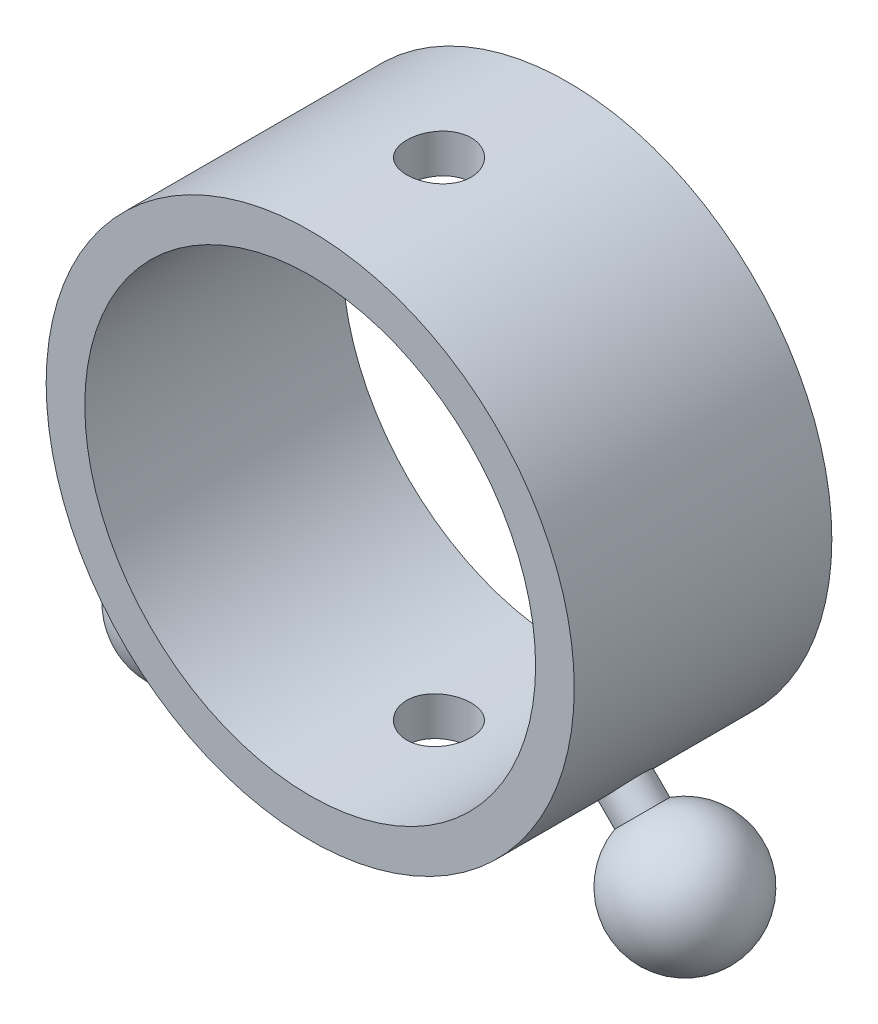
ISO-10303-21;
HEADER;
FILE_DESCRIPTION(('STEP AP214'),'2;1');
FILE_NAME('part.step','',(''),(''),'','','');
FILE_SCHEMA(('AUTOMOTIVE_DESIGN { 1 0 10303 214 1 1 1 1 }'));
ENDSEC;
DATA;
#1=APPLICATION_CONTEXT('core data for automotive mechanical design processes');
#2=APPLICATION_PROTOCOL_DEFINITION('international standard','automotive_design',2000,#1);
#3=PRODUCT_CONTEXT('',#1,'mechanical');
#4=PRODUCT('Part','Part','',(#3));
#5=PRODUCT_RELATED_PRODUCT_CATEGORY('part','',(#4));
#6=PRODUCT_DEFINITION_FORMATION('','',#4);
#7=PRODUCT_DEFINITION_CONTEXT('part definition',#1,'design');
#8=PRODUCT_DEFINITION('design','',#6,#7);
#9=PRODUCT_DEFINITION_SHAPE('','',#8);
#10=(LENGTH_UNIT() NAMED_UNIT(*) SI_UNIT(.MILLI.,.METRE.));
#11=(NAMED_UNIT(*) PLANE_ANGLE_UNIT() SI_UNIT($,.RADIAN.));
#12=(NAMED_UNIT(*) SI_UNIT($,.STERADIAN.) SOLID_ANGLE_UNIT());
#13=UNCERTAINTY_MEASURE_WITH_UNIT(LENGTH_MEASURE(1.E-05),#10,'distance_accuracy_value','');
#14=(GEOMETRIC_REPRESENTATION_CONTEXT(3) GLOBAL_UNCERTAINTY_ASSIGNED_CONTEXT((#13)) GLOBAL_UNIT_ASSIGNED_CONTEXT((#10,
#11,#12)) REPRESENTATION_CONTEXT('',''));
#15=CARTESIAN_POINT('',(0.,0.,0.));
#16=DIRECTION('',(0.,0.,1.));
#17=DIRECTION('',(1.,0.,0.));
#18=AXIS2_PLACEMENT_3D('',#15,#16,#17);
#19=CARTESIAN_POINT('',(0.,0.,20.));
#20=DIRECTION('',(0.,0.,1.));
#21=DIRECTION('',(1.,0.,0.));
#22=AXIS2_PLACEMENT_3D('',#19,#20,#21);
#23=PLANE('',#22);
#24=CARTESIAN_POINT('',(0.,0.,20.));
#25=DIRECTION('',(0.,0.,1.));
#26=DIRECTION('',(1.,0.,0.));
#27=AXIS2_PLACEMENT_3D('',#24,#25,#26);
#28=CIRCLE('',#27,20.5);
#29=CARTESIAN_POINT('',(20.5,0.,20.));
#30=VERTEX_POINT('',#29);
#31=EDGE_CURVE('E10',#30,#30,#28,.T.);
#32=ORIENTED_EDGE('',*,*,#31,.T.);
#33=EDGE_LOOP('',(#32));
#34=FACE_BOUND('',#33,.T.);
#35=CARTESIAN_POINT('',(0.,0.,20.));
#36=DIRECTION('',(0.,0.,1.));
#37=DIRECTION('',(1.,0.,0.));
#38=AXIS2_PLACEMENT_3D('',#35,#36,#37);
#39=CIRCLE('',#38,17.5);
#40=CARTESIAN_POINT('',(17.5,0.,20.));
#41=VERTEX_POINT('',#40);
#42=EDGE_CURVE('E53',#41,#41,#39,.T.);
#43=ORIENTED_EDGE('',*,*,#42,.F.);
#44=EDGE_LOOP('',(#43));
#45=FACE_BOUND('',#44,.T.);
#46=ADVANCED_FACE('F35',(#34,#45),#23,.T.);
#47=CARTESIAN_POINT('',(0.,0.,0.));
#48=DIRECTION('',(0.,0.,1.));
#49=DIRECTION('',(1.,0.,0.));
#50=AXIS2_PLACEMENT_3D('',#47,#48,#49);
#51=PLANE('',#50);
#52=CARTESIAN_POINT('',(0.,0.,0.));
#53=DIRECTION('',(0.,0.,1.));
#54=DIRECTION('',(1.,0.,0.));
#55=AXIS2_PLACEMENT_3D('',#52,#53,#54);
#56=CIRCLE('',#55,20.5);
#57=CARTESIAN_POINT('',(20.5,0.,0.));
#58=VERTEX_POINT('',#57);
#59=EDGE_CURVE('E48',#58,#58,#56,.T.);
#60=ORIENTED_EDGE('',*,*,#59,.F.);
#61=EDGE_LOOP('',(#60));
#62=FACE_BOUND('',#61,.T.);
#63=CARTESIAN_POINT('',(0.,0.,0.));
#64=DIRECTION('',(0.,0.,1.));
#65=DIRECTION('',(1.,0.,0.));
#66=AXIS2_PLACEMENT_3D('',#63,#64,#65);
#67=CIRCLE('',#66,17.5);
#68=CARTESIAN_POINT('',(17.5,0.,0.));
#69=VERTEX_POINT('',#68);
#70=EDGE_CURVE('E56',#69,#69,#67,.T.);
#71=ORIENTED_EDGE('',*,*,#70,.T.);
#72=EDGE_LOOP('',(#71));
#73=FACE_BOUND('',#72,.T.);
#74=ADVANCED_FACE('F108',(#62,#73),#51,.F.);
#75=CARTESIAN_POINT('',(0.,0.,20.));
#76=DIRECTION('',(0.,0.,-1.));
#77=DIRECTION('',(-1.,0.,0.));
#78=AXIS2_PLACEMENT_3D('',#75,#76,#77);
#79=CYLINDRICAL_SURFACE('',#78,20.5);
#80=CARTESIAN_POINT('',(15.6802118774406,-13.2053381432877,10.));
#81=CARTESIAN_POINT('',(15.6802095499341,-13.2053418712242,9.90189406807006));
#82=CARTESIAN_POINT('',(15.6748639429321,-13.21169645185,9.80372156263362));
#83=CARTESIAN_POINT('',(15.6535765640971,-13.2369106091498,9.61009347966121));
#84=CARTESIAN_POINT('',(15.6376228228047,-13.2557843114459,9.51464109833742));
#85=CARTESIAN_POINT('',(15.5954603045762,-13.305362470367,9.32928563448839));
#86=CARTESIAN_POINT('',(15.5692573866514,-13.3360601675722,9.23937941539632));
#87=CARTESIAN_POINT('',(15.5071616550476,-13.4082136036596,9.0676177265313));
#88=CARTESIAN_POINT('',(15.4712708963669,-13.4496670609427,8.9857605544013));
#89=CARTESIAN_POINT('',(15.3904800469318,-13.5420414563442,8.83217944129506));
#90=CARTESIAN_POINT('',(15.3455586845684,-13.5929847265531,8.76048012001199));
#91=CARTESIAN_POINT('',(15.2477693316237,-13.7025878247089,8.62946155749786));
#92=CARTESIAN_POINT('',(15.1949009922184,-13.7612479913667,8.57014285997424));
#93=CARTESIAN_POINT('',(15.0823751712187,-13.8844849181916,8.46548704291591));
#94=CARTESIAN_POINT('',(15.0227075011476,-13.9490705283716,8.4201712934739));
#95=CARTESIAN_POINT('',(14.8981301498039,-14.0820456511112,8.34494441490909));
#96=CARTESIAN_POINT('',(14.8332205643426,-14.1504350941376,8.31503300430044));
#97=CARTESIAN_POINT('',(14.7000252252613,-14.2887525386023,8.27153493494704));
#98=CARTESIAN_POINT('',(14.6317481566045,-14.3586763480272,8.25790835618874));
#99=CARTESIAN_POINT('',(14.4935490330754,-14.498161032617,8.24724334016783));
#100=CARTESIAN_POINT('',(14.4236270101756,-14.567721914804,8.25020458075571));
#101=CARTESIAN_POINT('',(14.2843313043758,-14.7043318132396,8.27259852432415));
#102=CARTESIAN_POINT('',(14.2149566675479,-14.7713869007952,8.29198829952557));
#103=CARTESIAN_POINT('',(14.0786320421509,-14.9013756589611,8.34662214470073));
#104=CARTESIAN_POINT('',(14.0116820776217,-14.9643092887131,8.38186637182127));
#105=CARTESIAN_POINT('',(13.8821752698897,-15.0845296624517,8.46725642326782));
#106=CARTESIAN_POINT('',(13.8196242161077,-15.1418090033811,8.51742144730507));
#107=CARTESIAN_POINT('',(13.7009841587645,-15.2492441978772,8.6312151508545));
#108=CARTESIAN_POINT('',(13.6448952928907,-15.2993998996684,8.69484411715617));
#109=CARTESIAN_POINT('',(13.5408322152044,-15.3915795564668,8.83400139826774));
#110=CARTESIAN_POINT('',(13.4928844560971,-15.4335770646101,8.90956701934007));
#111=CARTESIAN_POINT('',(13.4069294179823,-15.5083041572713,9.070322642605));
#112=CARTESIAN_POINT('',(13.3689221477688,-15.54103373359,9.15551265331194));
#113=CARTESIAN_POINT('',(13.3041513002568,-15.596518399465,9.33312536636956));
#114=CARTESIAN_POINT('',(13.2773892088201,-15.6192721709032,9.42554902261246));
#115=CARTESIAN_POINT('',(13.2360598055393,-15.6543112722837,9.61499273975181));
#116=CARTESIAN_POINT('',(13.2214922244767,-15.666596833333,9.71201269912562));
#117=CARTESIAN_POINT('',(13.2050988255091,-15.6804171466832,9.90756754540038));
#118=CARTESIAN_POINT('',(13.2032329827334,-15.6819856698567,10.0060966920749));
#119=CARTESIAN_POINT('',(13.2122037021058,-15.6744284230576,10.2021606642161));
#120=CARTESIAN_POINT('',(13.2230401398334,-15.6653027578359,10.2996954994128));
#121=CARTESIAN_POINT('',(13.2570020910812,-15.6365720017845,10.4908521294877));
#122=CARTESIAN_POINT('',(13.2801089889609,-15.6169827850518,10.584479620777));
#123=CARTESIAN_POINT('',(13.3377890174351,-15.5677491479495,10.7653403462621));
#124=CARTESIAN_POINT('',(13.372362340929,-15.5381045584182,10.8525734728555));
#125=CARTESIAN_POINT('',(13.4518869347711,-15.4693082772273,11.0184079207005));
#126=CARTESIAN_POINT('',(13.496863847202,-15.4301330826029,11.0969871942638));
#127=CARTESIAN_POINT('',(13.5956353186484,-15.343174977388,11.2430604425205));
#128=CARTESIAN_POINT('',(13.6494300368251,-15.2953919114241,11.3105542170769));
#129=CARTESIAN_POINT('',(13.7642255709102,-15.1921709003411,11.4327188853367));
#130=CARTESIAN_POINT('',(13.8252448239408,-15.1367133061292,11.4873558597995));
#131=CARTESIAN_POINT('',(13.9524193913404,-15.0195691362832,11.582023175899));
#132=CARTESIAN_POINT('',(14.0185746522032,-14.957882625539,11.6220536696792));
#133=CARTESIAN_POINT('',(14.1538665256911,-14.8299262585087,11.686313541578));
#134=CARTESIAN_POINT('',(14.2229990610287,-14.7636625997729,11.7105638398513));
#135=CARTESIAN_POINT('',(14.3622368297491,-14.6282459648169,11.7426433069443));
#136=CARTESIAN_POINT('',(14.4323420436924,-14.5590930462851,11.7504728034698));
#137=CARTESIAN_POINT('',(14.5712587069493,-14.4200571067179,11.7494845077359));
#138=CARTESIAN_POINT('',(14.6400735604329,-14.3501771052349,11.740719553745));
#139=CARTESIAN_POINT('',(14.7747278422573,-14.2115010394525,11.7069014163339));
#140=CARTESIAN_POINT('',(14.8405672667229,-14.1427049765649,11.6818482117014));
#141=CARTESIAN_POINT('',(14.9675277377449,-14.0082714221973,11.6161783138607));
#142=CARTESIAN_POINT('',(15.0286490932711,-13.9426337239934,11.5755626408247));
#143=CARTESIAN_POINT('',(15.1446493903335,-13.8165459941414,11.4799267296526));
#144=CARTESIAN_POINT('',(15.1995284235212,-13.7560958863308,11.4249067030445));
#145=CARTESIAN_POINT('',(15.3019004778872,-13.642130974044,11.3018255238684));
#146=CARTESIAN_POINT('',(15.3493705347097,-13.5886378150545,11.2337252286454));
#147=CARTESIAN_POINT('',(15.4356522247743,-13.4905492795558,11.086488341774));
#148=CARTESIAN_POINT('',(15.4744617606051,-13.4459560587159,11.0073490842264));
#149=CARTESIAN_POINT('',(15.5426194258335,-13.3671130442293,10.840119793068));
#150=CARTESIAN_POINT('',(15.5719489844733,-13.3328835607742,10.7520126302481));
#151=CARTESIAN_POINT('',(15.6203842713843,-13.2761063882086,10.5695327160773));
#152=CARTESIAN_POINT('',(15.6395017294739,-13.2535452975056,10.4751672938091));
#153=CARTESIAN_POINT('',(15.6622629566268,-13.226628383726,10.3168729986806));
#154=CARTESIAN_POINT('',(15.6689868803741,-13.2186572435776,10.253961549353));
#155=CARTESIAN_POINT('',(15.6779620900637,-13.2080109205843,10.127376088046));
#156=CARTESIAN_POINT('',(15.6802133887356,-13.2053357226665,10.0637020782373));
#157=CARTESIAN_POINT('',(15.6802118774406,-13.2053381432877,10.));
#158=B_SPLINE_CURVE_WITH_KNOTS('',3,(#80,#81,#82,#83,#84,#85,#86,#87,#88,#89,#90,#91,#92,#93,
#94,#95,#96,#97,#98,#99,#100,#101,#102,#103,#104,#105,#106,#107,#108,#109,#110,#111,#112,#113,
#114,#115,#116,#117,#118,#119,#120,#121,#122,#123,#124,#125,#126,#127,#128,#129,#130,#131,#132,
#133,#134,#135,#136,#137,#138,#139,#140,#141,#142,#143,#144,#145,#146,#147,#148,#149,#150,#151,
#152,#153,#154,#155,#156,#157),.UNSPECIFIED.,.T.,.F.,(4,2,2,2,2,2,2,2,2,2,2,2,2,2,2,2,2,2,2,2,2,
2,2,2,2,2,2,2,2,2,2,2,2,2,2,2,2,2,4),(0.,0.294085203030158,0.588502795108223,0.882752326769117,
1.17693949078888,1.4718279086263,1.76672927405903,2.06207849483801,2.35742231846355,
2.65204065266446,2.94665326514733,3.24049842027066,3.53434648800414,3.8285743201263,
4.12280842009636,4.41798099463074,4.71315383029531,5.00836565584514,5.30357096382477,
5.5978456081656,5.89211737007211,6.18594395940839,6.47977549203482,6.7743391072047,
7.06890803982337,7.36424561284294,7.65958010949212,7.9545222726501,8.24945854966627,
8.5434573013327,8.83745643587713,9.1314363010826,9.42541184943327,9.72028122469876,
10.0152219343351,10.3107369634912,10.6059118244259,10.7968675756404,10.9878227833767),.UNSPECIFIED.);
#159=CARTESIAN_POINT('',(15.6802118774406,-13.2053381432877,10.));
#160=VERTEX_POINT('',#159);
#161=EDGE_CURVE('E40',#160,#160,#158,.T.);
#162=ORIENTED_EDGE('',*,*,#161,.T.);
#163=EDGE_LOOP('',(#162));
#164=FACE_BOUND('',#163,.T.);
#165=CARTESIAN_POINT('',(-15.6802118774406,-13.2053381432877,10.));
#166=CARTESIAN_POINT('',(-15.6802095499341,-13.2053418712242,10.0981059319299));
#167=CARTESIAN_POINT('',(-15.6748639429321,-13.21169645185,10.1962784373664));
#168=CARTESIAN_POINT('',(-15.6535765640971,-13.2369106091498,10.3899065203388));
#169=CARTESIAN_POINT('',(-15.6376228228047,-13.2557843114459,10.4853589016626));
#170=CARTESIAN_POINT('',(-15.5954603045762,-13.305362470367,10.6707143655116));
#171=CARTESIAN_POINT('',(-15.5692573866514,-13.3360601675722,10.7606205846037));
#172=CARTESIAN_POINT('',(-15.5071616550476,-13.4082136036596,10.9323822734687));
#173=CARTESIAN_POINT('',(-15.4712708963669,-13.4496670609427,11.0142394455987));
#174=CARTESIAN_POINT('',(-15.3904800469318,-13.5420414563442,11.1678205587049));
#175=CARTESIAN_POINT('',(-15.3455586845684,-13.5929847265531,11.239519879988));
#176=CARTESIAN_POINT('',(-15.2477693316237,-13.7025878247089,11.3705384425021));
#177=CARTESIAN_POINT('',(-15.1949009922183,-13.7612479913667,11.4298571400258));
#178=CARTESIAN_POINT('',(-15.0823751712187,-13.8844849181916,11.5345129570841));
#179=CARTESIAN_POINT('',(-15.0227075011476,-13.9490705283716,11.5798287065261));
#180=CARTESIAN_POINT('',(-14.8981301498039,-14.0820456511112,11.6550555850909));
#181=CARTESIAN_POINT('',(-14.8332205643426,-14.1504350941376,11.6849669956996));
#182=CARTESIAN_POINT('',(-14.7000252252613,-14.2887525386023,11.728465065053));
#183=CARTESIAN_POINT('',(-14.6317481566045,-14.3586763480272,11.7420916438113));
#184=CARTESIAN_POINT('',(-14.4935490330754,-14.498161032617,11.7527566598322));
#185=CARTESIAN_POINT('',(-14.4236270101756,-14.567721914804,11.7497954192443));
#186=CARTESIAN_POINT('',(-14.2843313043758,-14.7043318132396,11.7274014756759));
#187=CARTESIAN_POINT('',(-14.2149566675479,-14.7713869007952,11.7080117004744));
#188=CARTESIAN_POINT('',(-14.0786320421509,-14.9013756589611,11.6533778552993));
#189=CARTESIAN_POINT('',(-14.0116820776217,-14.9643092887131,11.6181336281787));
#190=CARTESIAN_POINT('',(-13.8821752698897,-15.0845296624517,11.5327435767322));
#191=CARTESIAN_POINT('',(-13.8196242161077,-15.1418090033811,11.4825785526949));
#192=CARTESIAN_POINT('',(-13.7009841587645,-15.2492441978772,11.3687848491455));
#193=CARTESIAN_POINT('',(-13.6448952928907,-15.2993998996684,11.3051558828438));
#194=CARTESIAN_POINT('',(-13.5408322152044,-15.3915795564668,11.1659986017323));
#195=CARTESIAN_POINT('',(-13.4928844560971,-15.4335770646101,11.0904329806599));
#196=CARTESIAN_POINT('',(-13.4069294179823,-15.5083041572713,10.929677357395));
#197=CARTESIAN_POINT('',(-13.3689221477688,-15.54103373359,10.8444873466881));
#198=CARTESIAN_POINT('',(-13.3041513002568,-15.596518399465,10.6668746336304));
#199=CARTESIAN_POINT('',(-13.2773892088201,-15.6192721709032,10.5744509773875));
#200=CARTESIAN_POINT('',(-13.2360598055393,-15.6543112722837,10.3850072602482));
#201=CARTESIAN_POINT('',(-13.2214922244767,-15.666596833333,10.2879873008744));
#202=CARTESIAN_POINT('',(-13.2050988255091,-15.6804171466832,10.0924324545996));
#203=CARTESIAN_POINT('',(-13.2032329827334,-15.6819856698567,9.99390330792515));
#204=CARTESIAN_POINT('',(-13.2122037021058,-15.6744284230576,9.79783933578392));
#205=CARTESIAN_POINT('',(-13.2230401398334,-15.6653027578359,9.7003045005872));
#206=CARTESIAN_POINT('',(-13.2570020910812,-15.6365720017845,9.50914787051232));
#207=CARTESIAN_POINT('',(-13.2801089889609,-15.6169827850518,9.41552037922298));
#208=CARTESIAN_POINT('',(-13.3377890174351,-15.5677491479495,9.23465965373788));
#209=CARTESIAN_POINT('',(-13.372362340929,-15.5381045584182,9.14742652714453));
#210=CARTESIAN_POINT('',(-13.4518869347711,-15.4693082772273,8.98159207929946));
#211=CARTESIAN_POINT('',(-13.496863847202,-15.4301330826029,8.90301280573616));
#212=CARTESIAN_POINT('',(-13.5956353186484,-15.343174977388,8.75693955747954));
#213=CARTESIAN_POINT('',(-13.6494300368251,-15.2953919114241,8.68944578292312));
#214=CARTESIAN_POINT('',(-13.7642255709102,-15.1921709003411,8.56728111466328));
#215=CARTESIAN_POINT('',(-13.8252448239408,-15.1367133061292,8.51264414020051));
#216=CARTESIAN_POINT('',(-13.9524193913404,-15.0195691362832,8.41797682410095));
#217=CARTESIAN_POINT('',(-14.0185746522032,-14.957882625539,8.37794633032076));
#218=CARTESIAN_POINT('',(-14.1538665256911,-14.8299262585087,8.31368645842199));
#219=CARTESIAN_POINT('',(-14.2229990610287,-14.7636625997729,8.28943616014871));
#220=CARTESIAN_POINT('',(-14.3622368297491,-14.6282459648169,8.2573566930557));
#221=CARTESIAN_POINT('',(-14.4323420436924,-14.5590930462851,8.2495271965302));
#222=CARTESIAN_POINT('',(-14.5712587069493,-14.4200571067179,8.25051549226407));
#223=CARTESIAN_POINT('',(-14.6400735604329,-14.3501771052349,8.25928044625499));
#224=CARTESIAN_POINT('',(-14.7747278422573,-14.2115010394525,8.29309858366608));
#225=CARTESIAN_POINT('',(-14.8405672667229,-14.1427049765649,8.3181517882986));
#226=CARTESIAN_POINT('',(-14.9675277377449,-14.0082714221973,8.38382168613934));
#227=CARTESIAN_POINT('',(-15.0286490932711,-13.9426337239934,8.42443735917525));
#228=CARTESIAN_POINT('',(-15.1446493903335,-13.8165459941414,8.52007327034737));
#229=CARTESIAN_POINT('',(-15.1995284235212,-13.7560958863308,8.57509329695552));
#230=CARTESIAN_POINT('',(-15.3019004778872,-13.642130974044,8.69817447613163));
#231=CARTESIAN_POINT('',(-15.3493705347097,-13.5886378150545,8.76627477135462));
#232=CARTESIAN_POINT('',(-15.4356522247743,-13.4905492795558,8.913511658226));
#233=CARTESIAN_POINT('',(-15.4744617606051,-13.4459560587159,8.99265091577365));
#234=CARTESIAN_POINT('',(-15.5426194258335,-13.3671130442293,9.15988020693203));
#235=CARTESIAN_POINT('',(-15.5719489844733,-13.3328835607742,9.24798736975191));
#236=CARTESIAN_POINT('',(-15.6203842713843,-13.2761063882086,9.43046728392273));
#237=CARTESIAN_POINT('',(-15.6395017294739,-13.2535452975056,9.5248327061909));
#238=CARTESIAN_POINT('',(-15.6622629566268,-13.226628383726,9.68312700131943));
#239=CARTESIAN_POINT('',(-15.6689868803741,-13.2186572435776,9.74603845064697));
#240=CARTESIAN_POINT('',(-15.6779620900637,-13.2080109205843,9.87262391195404));
#241=CARTESIAN_POINT('',(-15.6802133887356,-13.2053357226665,9.93629792176272));
#242=CARTESIAN_POINT('',(-15.6802118774406,-13.2053381432877,10.));
#243=B_SPLINE_CURVE_WITH_KNOTS('',3,(#165,#166,#167,#168,#169,#170,#171,#172,#173,#174,#175,
#176,#177,#178,#179,#180,#181,#182,#183,#184,#185,#186,#187,#188,#189,#190,#191,#192,#193,#194,
#195,#196,#197,#198,#199,#200,#201,#202,#203,#204,#205,#206,#207,#208,#209,#210,#211,#212,#213,
#214,#215,#216,#217,#218,#219,#220,#221,#222,#223,#224,#225,#226,#227,#228,#229,#230,#231,#232,
#233,#234,#235,#236,#237,#238,#239,#240,#241,#242),.UNSPECIFIED.,.T.,.F.,(4,2,2,2,2,2,2,2,2,2,2,
2,2,2,2,2,2,2,2,2,2,2,2,2,2,2,2,2,2,2,2,2,2,2,2,2,2,2,4),(0.,0.294085203030158,
0.588502795108223,0.882752326769117,1.17693949078888,1.4718279086263,1.76672927405903,
2.06207849483801,2.35742231846355,2.65204065266446,2.94665326514733,3.24049842027066,
3.53434648800414,3.8285743201263,4.12280842009636,4.41798099463074,4.71315383029531,
5.00836565584514,5.30357096382477,5.5978456081656,5.89211737007211,6.18594395940839,
6.47977549203482,6.7743391072047,7.06890803982337,7.36424561284294,7.65958010949212,
7.9545222726501,8.24945854966627,8.5434573013327,8.83745643587713,9.1314363010826,
9.42541184943326,9.72028122469875,10.0152219343351,10.3107369634912,10.6059118244259,
10.7968675756404,10.9878227833767),.UNSPECIFIED.);
#244=CARTESIAN_POINT('',(-15.6802118774406,-13.2053381432877,10.));
#245=VERTEX_POINT('',#244);
#246=EDGE_CURVE('E68',#245,#245,#243,.T.);
#247=ORIENTED_EDGE('',*,*,#246,.T.);
#248=EDGE_LOOP('',(#247));
#249=FACE_BOUND('',#248,.T.);
#250=CARTESIAN_POINT('',(0.,-20.5,12.5));
#251=CARTESIAN_POINT('',(0.139869123188127,-20.4999980878438,12.4999940410944));
#252=CARTESIAN_POINT('',(0.279826327897071,-20.4985534034391,12.4882224079843));
#253=CARTESIAN_POINT('',(0.555848128422062,-20.4929292278898,12.4414477905698));
#254=CARTESIAN_POINT('',(0.691908472556159,-20.4887468601749,12.4064203701228));
#255=CARTESIAN_POINT('',(0.95610046242423,-20.4781186112359,12.3141798637469));
#256=CARTESIAN_POINT('',(1.08423730679542,-20.4716742330629,12.2569815072408));
#257=CARTESIAN_POINT('',(1.32906818282374,-20.4572392219344,12.1220545297081));
#258=CARTESIAN_POINT('',(1.44576421399806,-20.4492488598999,12.0443295049408));
#259=CARTESIAN_POINT('',(1.66503849039571,-20.4325674768161,11.8701189813045));
#260=CARTESIAN_POINT('',(1.76754802177386,-20.4238733481243,11.7735472830164));
#261=CARTESIAN_POINT('',(1.95494779193525,-20.4067894549476,11.5645696887252));
#262=CARTESIAN_POINT('',(2.03983714431359,-20.3983997057924,11.4521629966004));
#263=CARTESIAN_POINT('',(2.18984130089014,-20.3828437824326,11.2142616587094));
#264=CARTESIAN_POINT('',(2.25489199323375,-20.3756816073178,11.0887263044314));
#265=CARTESIAN_POINT('',(2.36296285881032,-20.3634324796364,10.8284112925043));
#266=CARTESIAN_POINT('',(2.40598382809384,-20.3583454520851,10.6936319690884));
#267=CARTESIAN_POINT('',(2.46856584360533,-20.3508521010387,10.419366679739));
#268=CARTESIAN_POINT('',(2.48824268138042,-20.3484325505926,10.2799075028382));
#269=CARTESIAN_POINT('',(2.50393613091904,-20.3465075617647,9.99964697510323));
#270=CARTESIAN_POINT('',(2.49995364986796,-20.3470020116495,9.85884567593759));
#271=CARTESIAN_POINT('',(2.46853661075238,-20.3508370540421,9.58070352846002));
#272=CARTESIAN_POINT('',(2.44122945108143,-20.3541621851607,9.44334804665829));
#273=CARTESIAN_POINT('',(2.36413690471302,-20.3632598134937,9.17518382607852));
#274=CARTESIAN_POINT('',(2.31435108267713,-20.3690323581063,9.04437521414651));
#275=CARTESIAN_POINT('',(2.19357702307872,-20.3823919620412,8.79262124172246));
#276=CARTESIAN_POINT('',(2.12253326899719,-20.3899837620037,8.6717027760214));
#277=CARTESIAN_POINT('',(1.9612997543577,-20.4061227660853,8.44345618199504));
#278=CARTESIAN_POINT('',(1.87110916008802,-20.4146700117998,8.3361286457852));
#279=CARTESIAN_POINT('',(1.67343536282853,-20.4318256058383,8.13737097063586));
#280=CARTESIAN_POINT('',(1.56584232030561,-20.4404339862829,8.04605003950524));
#281=CARTESIAN_POINT('',(1.33679641704889,-20.4566892422357,7.88274763680572));
#282=CARTESIAN_POINT('',(1.21534352692198,-20.4643361157046,7.81076620625193));
#283=CARTESIAN_POINT('',(0.961942453503863,-20.4778111869111,7.68818660885676));
#284=CARTESIAN_POINT('',(0.829991014312028,-20.4836388176688,7.63759510659955));
#285=CARTESIAN_POINT('',(0.559379110513887,-20.4928135746535,7.55931727641664));
#286=CARTESIAN_POINT('',(0.420718945069138,-20.49616081138,7.53162992812293));
#287=CARTESIAN_POINT('',(0.1415701012613,-20.499983298315,7.50008748892893));
#288=CARTESIAN_POINT('',(0.00109866411520914,-20.5004766814259,7.49608192437812));
#289=CARTESIAN_POINT('',(-0.278513488032522,-20.4985847836311,7.5116199058911));
#290=CARTESIAN_POINT('',(-0.417654229920532,-20.4961995610112,7.53116297514304));
#291=CARTESIAN_POINT('',(-0.690212592008819,-20.4888297937433,7.59311848429211));
#292=CARTESIAN_POINT('',(-0.823646720805516,-20.4838533859189,7.63545934879526));
#293=CARTESIAN_POINT('',(-1.08152018795814,-20.4718585362878,7.74173424709705));
#294=CARTESIAN_POINT('',(-1.20595923420212,-20.4648400282019,7.80566898176643));
#295=CARTESIAN_POINT('',(-1.44298330673746,-20.4494985824716,7.95368202476156));
#296=CARTESIAN_POINT('',(-1.55550701148273,-20.4411693981029,8.03785787325795));
#297=CARTESIAN_POINT('',(-1.76488280036678,-20.4241583444827,8.2238254604508));
#298=CARTESIAN_POINT('',(-1.86173429319863,-20.4154764619394,8.32561786351379));
#299=CARTESIAN_POINT('',(-2.03754876066554,-20.3986827494851,8.54459105317552));
#300=CARTESIAN_POINT('',(-2.11641211947436,-20.3905742578111,8.66185211489081));
#301=CARTESIAN_POINT('',(-2.25332394518983,-20.3758997955866,8.90804362289752));
#302=CARTESIAN_POINT('',(-2.31137281230297,-20.3693337953789,9.03697384476279));
#303=CARTESIAN_POINT('',(-2.40484584882741,-20.3585102609397,9.30251970540025));
#304=CARTESIAN_POINT('',(-2.44032659591996,-20.3542469579912,9.43911518351363));
#305=CARTESIAN_POINT('',(-2.48783861755255,-20.3484948129084,9.71638044770618));
#306=CARTESIAN_POINT('',(-2.49987092626404,-20.3470058484145,9.85705005382203));
#307=CARTESIAN_POINT('',(-2.50012616578674,-20.3469744078954,10.1374795809127));
#308=CARTESIAN_POINT('',(-2.48850559134322,-20.3484125651299,10.2772393831644));
#309=CARTESIAN_POINT('',(-2.44211588831925,-20.3540317331791,10.5528038833551));
#310=CARTESIAN_POINT('',(-2.40734675363121,-20.3582127447173,10.6886085802506));
#311=CARTESIAN_POINT('',(-2.31569508695304,-20.3688406201213,10.9523898272141));
#312=CARTESIAN_POINT('',(-2.25881970963105,-20.3752867508182,11.0803688945471));
#313=CARTESIAN_POINT('',(-2.1245854827553,-20.3897197982784,11.3249915606426));
#314=CARTESIAN_POINT('',(-2.04722642553544,-20.3977067306621,11.4416350444671));
#315=CARTESIAN_POINT('',(-1.87363904107251,-20.4143847867706,11.6610758318116));
#316=CARTESIAN_POINT('',(-1.7772940424403,-20.4230800590744,11.7637805337213));
#317=CARTESIAN_POINT('',(-1.56871201196928,-20.4401582300421,11.9516257002976));
#318=CARTESIAN_POINT('',(-1.45647123133381,-20.4485410544288,12.0367620100352));
#319=CARTESIAN_POINT('',(-1.21881917940721,-20.464083174829,12.1873144009209));
#320=CARTESIAN_POINT('',(-1.09336163682965,-20.4712379250669,12.2526578722758));
#321=CARTESIAN_POINT('',(-0.833238431847765,-20.483471356433,12.3612571946792));
#322=CARTESIAN_POINT('',(-0.698583008783331,-20.4885523035864,12.404537167259));
#323=CARTESIAN_POINT('',(-0.469351543898307,-20.4948338590668,12.4573630009044));
#324=CARTESIAN_POINT('',(-0.376223877687019,-20.4967617781774,12.4733290496081));
#325=CARTESIAN_POINT('',(-0.188744173870796,-20.4993454894773,12.4946495232847));
#326=CARTESIAN_POINT('',(-0.0943921447130181,-20.5000012904387,12.5000040214299));
#327=CARTESIAN_POINT('',(0.,-20.5,12.5));
#328=B_SPLINE_CURVE_WITH_KNOTS('',3,(#250,#251,#252,#253,#254,#255,#256,#257,#258,#259,#260,
#261,#262,#263,#264,#265,#266,#267,#268,#269,#270,#271,#272,#273,#274,#275,#276,#277,#278,#279,
#280,#281,#282,#283,#284,#285,#286,#287,#288,#289,#290,#291,#292,#293,#294,#295,#296,#297,#298,
#299,#300,#301,#302,#303,#304,#305,#306,#307,#308,#309,#310,#311,#312,#313,#314,#315,#316,#317,
#318,#319,#320,#321,#322,#323,#324,#325,#326,#327),.UNSPECIFIED.,.T.,.F.,(4,2,2,2,2,2,2,2,2,2,2,
2,2,2,2,2,2,2,2,2,2,2,2,2,2,2,2,2,2,2,2,2,2,2,2,2,2,2,4),(0.,0.419262598489233,
0.838966438083255,1.25839192096726,1.67774396946503,2.09906097537827,2.52039917103077,
2.94308490305296,3.36575536012317,3.78632040322337,4.2068693204153,4.62513579909758,
5.043410378586,5.46278698831195,5.88218186271907,6.30433529026212,6.72648961309872,
7.14877537224998,7.57104231777955,7.99062327801887,8.41019574274135,8.82845854430721,
9.24673492270456,9.66706882259539,10.0874185778372,10.5100425203419,10.9326583364934,
11.3542104461688,11.7757439632617,12.1944975517991,12.6132512508221,13.0318695332409,
13.4504920598263,13.8717721568848,14.2931517728913,14.7160589981684,15.1385028714758,
15.4214485843091,15.7043923460721),.UNSPECIFIED.);
#329=CARTESIAN_POINT('',(0.,-20.5,12.5));
#330=VERTEX_POINT('',#329);
#331=EDGE_CURVE('E95',#330,#330,#328,.T.);
#332=ORIENTED_EDGE('',*,*,#331,.T.);
#333=EDGE_LOOP('',(#332));
#334=FACE_BOUND('',#333,.T.);
#335=CARTESIAN_POINT('',(0.,20.5,12.5));
#336=CARTESIAN_POINT('',(-0.139869123188126,20.4999980878438,12.4999940410944));
#337=CARTESIAN_POINT('',(-0.27982632789707,20.4985534034391,12.4882224079843));
#338=CARTESIAN_POINT('',(-0.555848128422061,20.4929292278898,12.4414477905698));
#339=CARTESIAN_POINT('',(-0.691908472556159,20.4887468601749,12.4064203701228));
#340=CARTESIAN_POINT('',(-0.956100462424229,20.4781186112359,12.3141798637469));
#341=CARTESIAN_POINT('',(-1.08423730679542,20.4716742330629,12.2569815072408));
#342=CARTESIAN_POINT('',(-1.32906818282374,20.4572392219344,12.1220545297081));
#343=CARTESIAN_POINT('',(-1.44576421399806,20.4492488598999,12.0443295049408));
#344=CARTESIAN_POINT('',(-1.66503849039571,20.4325674768161,11.8701189813045));
#345=CARTESIAN_POINT('',(-1.76754802177386,20.4238733481243,11.7735472830164));
#346=CARTESIAN_POINT('',(-1.95494779193525,20.4067894549476,11.5645696887252));
#347=CARTESIAN_POINT('',(-2.03983714431359,20.3983997057924,11.4521629966004));
#348=CARTESIAN_POINT('',(-2.18984130089014,20.3828437824326,11.2142616587094));
#349=CARTESIAN_POINT('',(-2.25489199323375,20.3756816073178,11.0887263044314));
#350=CARTESIAN_POINT('',(-2.36296285881032,20.3634324796364,10.8284112925043));
#351=CARTESIAN_POINT('',(-2.40598382809384,20.3583454520851,10.6936319690884));
#352=CARTESIAN_POINT('',(-2.46856584360533,20.3508521010387,10.4193666797389));
#353=CARTESIAN_POINT('',(-2.48824268138042,20.3484325505926,10.2799075028382));
#354=CARTESIAN_POINT('',(-2.50393613091903,20.3465075617647,9.99964697510323));
#355=CARTESIAN_POINT('',(-2.49995364986796,20.3470020116495,9.85884567593759));
#356=CARTESIAN_POINT('',(-2.46853661075238,20.3508370540421,9.58070352846002));
#357=CARTESIAN_POINT('',(-2.44122945108142,20.3541621851607,9.44334804665829));
#358=CARTESIAN_POINT('',(-2.36413690471302,20.3632598134937,9.17518382607852));
#359=CARTESIAN_POINT('',(-2.31435108267713,20.3690323581063,9.04437521414651));
#360=CARTESIAN_POINT('',(-2.19357702307872,20.3823919620412,8.79262124172246));
#361=CARTESIAN_POINT('',(-2.12253326899719,20.3899837620037,8.6717027760214));
#362=CARTESIAN_POINT('',(-1.96129975435769,20.4061227660853,8.44345618199504));
#363=CARTESIAN_POINT('',(-1.87110916008802,20.4146700117998,8.3361286457852));
#364=CARTESIAN_POINT('',(-1.67343536282852,20.4318256058383,8.13737097063586));
#365=CARTESIAN_POINT('',(-1.56584232030561,20.4404339862829,8.04605003950524));
#366=CARTESIAN_POINT('',(-1.33679641704889,20.4566892422357,7.88274763680572));
#367=CARTESIAN_POINT('',(-1.21534352692197,20.4643361157046,7.81076620625193));
#368=CARTESIAN_POINT('',(-0.961942453503859,20.4778111869111,7.68818660885675));
#369=CARTESIAN_POINT('',(-0.829991014312024,20.4836388176688,7.63759510659955));
#370=CARTESIAN_POINT('',(-0.559379110513882,20.4928135746535,7.55931727641664));
#371=CARTESIAN_POINT('',(-0.420718945069133,20.49616081138,7.53162992812293));
#372=CARTESIAN_POINT('',(-0.141570101261295,20.499983298315,7.50008748892893));
#373=CARTESIAN_POINT('',(-0.00109866411520412,20.5004766814259,7.49608192437812));
#374=CARTESIAN_POINT('',(0.278513488032526,20.4985847836311,7.5116199058911));
#375=CARTESIAN_POINT('',(0.417654229920537,20.4961995610112,7.53116297514304));
#376=CARTESIAN_POINT('',(0.690212592008824,20.4888297937433,7.59311848429211));
#377=CARTESIAN_POINT('',(0.823646720805521,20.4838533859189,7.63545934879526));
#378=CARTESIAN_POINT('',(1.08152018795814,20.4718585362878,7.74173424709705));
#379=CARTESIAN_POINT('',(1.20595923420212,20.4648400282019,7.80566898176643));
#380=CARTESIAN_POINT('',(1.44298330673747,20.4494985824716,7.95368202476156));
#381=CARTESIAN_POINT('',(1.55550701148273,20.4411693981029,8.03785787325795));
#382=CARTESIAN_POINT('',(1.76488280036678,20.4241583444827,8.2238254604508));
#383=CARTESIAN_POINT('',(1.86173429319864,20.4154764619394,8.32561786351379));
#384=CARTESIAN_POINT('',(2.03754876066555,20.3986827494851,8.54459105317552));
#385=CARTESIAN_POINT('',(2.11641211947436,20.3905742578111,8.66185211489081));
#386=CARTESIAN_POINT('',(2.25332394518984,20.3758997955866,8.90804362289752));
#387=CARTESIAN_POINT('',(2.31137281230297,20.3693337953789,9.03697384476279));
#388=CARTESIAN_POINT('',(2.40484584882741,20.3585102609397,9.30251970540025));
#389=CARTESIAN_POINT('',(2.44032659591997,20.3542469579912,9.43911518351363));
#390=CARTESIAN_POINT('',(2.48783861755255,20.3484948129084,9.71638044770619));
#391=CARTESIAN_POINT('',(2.49987092626404,20.3470058484145,9.85705005382203));
#392=CARTESIAN_POINT('',(2.50012616578674,20.3469744078954,10.1374795809127));
#393=CARTESIAN_POINT('',(2.48850559134322,20.3484125651299,10.2772393831644));
#394=CARTESIAN_POINT('',(2.44211588831925,20.3540317331791,10.5528038833551));
#395=CARTESIAN_POINT('',(2.40734675363121,20.3582127447173,10.6886085802506));
#396=CARTESIAN_POINT('',(2.31569508695305,20.3688406201213,10.9523898272141));
#397=CARTESIAN_POINT('',(2.25881970963105,20.3752867508182,11.0803688945471));
#398=CARTESIAN_POINT('',(2.1245854827553,20.3897197982784,11.3249915606426));
#399=CARTESIAN_POINT('',(2.04722642553545,20.3977067306621,11.4416350444671));
#400=CARTESIAN_POINT('',(1.87363904107251,20.4143847867706,11.6610758318116));
#401=CARTESIAN_POINT('',(1.77729404244031,20.4230800590744,11.7637805337213));
#402=CARTESIAN_POINT('',(1.56871201196929,20.4401582300421,11.9516257002976));
#403=CARTESIAN_POINT('',(1.45647123133382,20.4485410544288,12.0367620100352));
#404=CARTESIAN_POINT('',(1.21881917940721,20.464083174829,12.1873144009209));
#405=CARTESIAN_POINT('',(1.09336163682965,20.4712379250669,12.2526578722758));
#406=CARTESIAN_POINT('',(0.833238431847767,20.483471356433,12.3612571946792));
#407=CARTESIAN_POINT('',(0.698583008783333,20.4885523035864,12.404537167259));
#408=CARTESIAN_POINT('',(0.469351543898308,20.4948338590668,12.4573630009044));
#409=CARTESIAN_POINT('',(0.376223877687021,20.4967617781774,12.4733290496081));
#410=CARTESIAN_POINT('',(0.188744173870797,20.4993454894773,12.4946495232847));
#411=CARTESIAN_POINT('',(0.0943921447130195,20.5000012904387,12.5000040214299));
#412=CARTESIAN_POINT('',(0.,20.5,12.5));
#413=B_SPLINE_CURVE_WITH_KNOTS('',3,(#335,#336,#337,#338,#339,#340,#341,#342,#343,#344,#345,
#346,#347,#348,#349,#350,#351,#352,#353,#354,#355,#356,#357,#358,#359,#360,#361,#362,#363,#364,
#365,#366,#367,#368,#369,#370,#371,#372,#373,#374,#375,#376,#377,#378,#379,#380,#381,#382,#383,
#384,#385,#386,#387,#388,#389,#390,#391,#392,#393,#394,#395,#396,#397,#398,#399,#400,#401,#402,
#403,#404,#405,#406,#407,#408,#409,#410,#411,#412),.UNSPECIFIED.,.T.,.F.,(4,2,2,2,2,2,2,2,2,2,2,
2,2,2,2,2,2,2,2,2,2,2,2,2,2,2,2,2,2,2,2,2,2,2,2,2,2,2,4),(0.,0.419262598489233,
0.838966438083255,1.25839192096726,1.67774396946503,2.09906097537827,2.52039917103077,
2.94308490305296,3.36575536012317,3.78632040322337,4.2068693204153,4.62513579909758,
5.043410378586,5.46278698831195,5.88218186271907,6.30433529026212,6.72648961309872,
7.14877537224998,7.57104231777956,7.99062327801887,8.41019574274135,8.82845854430721,
9.24673492270456,9.66706882259538,10.0874185778372,10.5100425203419,10.9326583364934,
11.3542104461688,11.7757439632617,12.1944975517991,12.6132512508221,13.0318695332409,
13.4504920598263,13.8717721568848,14.2931517728913,14.7160589981684,15.1385028714758,
15.4214485843091,15.7043923460721),.UNSPECIFIED.);
#414=CARTESIAN_POINT('',(0.,20.5,12.5));
#415=VERTEX_POINT('',#414);
#416=EDGE_CURVE('E89',#415,#415,#413,.T.);
#417=ORIENTED_EDGE('',*,*,#416,.T.);
#418=EDGE_LOOP('',(#417));
#419=FACE_BOUND('',#418,.T.);
#420=ORIENTED_EDGE('',*,*,#31,.F.);
#421=EDGE_LOOP('',(#420));
#422=FACE_BOUND('',#421,.T.);
#423=ORIENTED_EDGE('',*,*,#59,.T.);
#424=EDGE_LOOP('',(#423));
#425=FACE_BOUND('',#424,.T.);
#426=ADVANCED_FACE('F37',(#164,#249,#334,#419,#422,#425),#79,.T.);
#427=CARTESIAN_POINT('',(0.,0.,20.));
#428=DIRECTION('',(0.,0.,-1.));
#429=DIRECTION('',(-1.,0.,0.));
#430=AXIS2_PLACEMENT_3D('',#427,#428,#429);
#431=CYLINDRICAL_SURFACE('',#430,17.5);
#432=CARTESIAN_POINT('',(0.,-17.5,12.5));
#433=CARTESIAN_POINT('',(0.139663411766028,-17.4999978380721,12.499994183528));
#434=CARTESIAN_POINT('',(0.279409763738793,-17.4983105050074,12.4882569821015));
#435=CARTESIAN_POINT('',(0.555001650920203,-17.4917417626469,12.441627159415));
#436=CARTESIAN_POINT('',(0.690843163833697,-17.4868571749077,12.406711495574));
#437=CARTESIAN_POINT('',(0.954596691963606,-17.4744432540456,12.3147848456644));
#438=CARTESIAN_POINT('',(1.08251442337443,-17.4669158542074,12.2577900079337));
#439=CARTESIAN_POINT('',(1.3269491256008,-17.4500497270147,12.1233611427616));
#440=CARTESIAN_POINT('',(1.44346778859663,-17.4407112691256,12.045930155376));
#441=CARTESIAN_POINT('',(1.66264662599328,-17.4211884780223,11.8722395720818));
#442=CARTESIAN_POINT('',(1.76521397700163,-17.4109991441869,11.7758633928552));
#443=CARTESIAN_POINT('',(1.95277822942157,-17.3909624955304,11.5672689636509));
#444=CARTESIAN_POINT('',(2.03777415677174,-17.3811151996951,11.4550498360087));
#445=CARTESIAN_POINT('',(2.18813969105557,-17.3628289122671,11.2173372098656));
#446=CARTESIAN_POINT('',(2.25342031368471,-17.3543963799907,11.0917868842871));
#447=CARTESIAN_POINT('',(2.36193362917025,-17.3399620664072,10.8313636512724));
#448=CARTESIAN_POINT('',(2.40516741136246,-17.3339601650054,10.6964912048167));
#449=CARTESIAN_POINT('',(2.46807330015292,-17.3251154844148,10.42222497543));
#450=CARTESIAN_POINT('',(2.48790372131989,-17.3222514880901,10.2828682001804));
#451=CARTESIAN_POINT('',(2.50393025018921,-17.3199423461355,10.002777736413));
#452=CARTESIAN_POINT('',(2.50012759067448,-17.320497022176,9.8620441200982));
#453=CARTESIAN_POINT('',(2.46912545244853,-17.3249431442757,9.58430863666732));
#454=CARTESIAN_POINT('',(2.44210170449124,-17.328809527553,9.44728669488537));
#455=CARTESIAN_POINT('',(2.36569930803572,-17.3394042922377,9.17974228428935));
#456=CARTESIAN_POINT('',(2.31632008118703,-17.3461327476885,9.04921998372209));
#457=CARTESIAN_POINT('',(2.19642380312384,-17.361721443382,8.79784181722893));
#458=CARTESIAN_POINT('',(2.12583173279085,-17.3705892270314,8.6770222190355));
#459=CARTESIAN_POINT('',(1.96556711430095,-17.3894518472516,8.44887696952675));
#460=CARTESIAN_POINT('',(1.87589342878138,-17.3994467509879,8.34155212317514));
#461=CARTESIAN_POINT('',(1.67904364678597,-17.4195483920113,8.14242399221342));
#462=CARTESIAN_POINT('',(1.57171634394402,-17.4296553221133,8.05077013735011));
#463=CARTESIAN_POINT('',(1.34312289850222,-17.4487579473899,7.88675374694184));
#464=CARTESIAN_POINT('',(1.22185670468123,-17.4577536384806,7.81439128229008));
#465=CARTESIAN_POINT('',(0.968702599534613,-17.4736283828367,7.69100640625177));
#466=CARTESIAN_POINT('',(0.836809319334139,-17.4805063576505,7.63999486313216));
#467=CARTESIAN_POINT('',(0.566208373442746,-17.4913614986505,7.56088632670063));
#468=CARTESIAN_POINT('',(0.427501125789105,-17.4953388425539,7.53278792952273));
#469=CARTESIAN_POINT('',(0.148500027987434,-17.4999211821592,7.50050046647446));
#470=CARTESIAN_POINT('',(0.00823042442799077,-17.500555170306,7.49610584191438));
#471=CARTESIAN_POINT('',(-0.271043562891617,-17.4984580908463,7.51080601002511));
#472=CARTESIAN_POINT('',(-0.410047981970071,-17.4957271174665,7.52990014495636));
#473=CARTESIAN_POINT('',(-0.682228022480607,-17.4872249216538,7.59086492699339));
#474=CARTESIAN_POINT('',(-0.815426381150151,-17.4814669841261,7.63263607397445));
#475=CARTESIAN_POINT('',(-1.07292868003085,-17.4675546784054,7.73766467411927));
#476=CARTESIAN_POINT('',(-1.19723223635135,-17.4594002068579,7.80092305397392));
#477=CARTESIAN_POINT('',(-1.43432461974732,-17.4415297146367,7.94761727123432));
#478=CARTESIAN_POINT('',(-1.54703151587246,-17.4318036856151,8.03118428713182));
#479=CARTESIAN_POINT('',(-1.75689411850607,-17.4119055803847,8.21594009506532));
#480=CARTESIAN_POINT('',(-1.85404900884822,-17.4017334808018,8.31712981135583));
#481=CARTESIAN_POINT('',(-2.03079205775958,-17.3819985021213,8.53517087620557));
#482=CARTESIAN_POINT('',(-2.11024287606047,-17.3724407693564,8.65213408787565));
#483=CARTESIAN_POINT('',(-2.24836960942393,-17.3551058935101,8.89786648325499));
#484=CARTESIAN_POINT('',(-2.30704604381354,-17.3473287059197,9.02663537173952));
#485=CARTESIAN_POINT('',(-2.40174263448166,-17.334472128272,9.29190413063286));
#486=CARTESIAN_POINT('',(-2.43783662664963,-17.3293839547404,9.42837719855163));
#487=CARTESIAN_POINT('',(-2.48657966500191,-17.3224576158054,9.70552570131951));
#488=CARTESIAN_POINT('',(-2.49923016741274,-17.3206192485359,9.8462008745971));
#489=CARTESIAN_POINT('',(-2.50069487967763,-17.3204077218135,10.1263922831516));
#490=CARTESIAN_POINT('',(-2.48972496709758,-17.3220031790397,10.2659074145691));
#491=CARTESIAN_POINT('',(-2.444721198135,-17.3284115526498,10.5410876550731));
#492=CARTESIAN_POINT('',(-2.41068736551688,-17.3332244657184,10.6767527681263));
#493=CARTESIAN_POINT('',(-2.32059556957245,-17.3455148684689,10.940331581389));
#494=CARTESIAN_POINT('',(-2.26455128703252,-17.3529907027211,11.0682500397038));
#495=CARTESIAN_POINT('',(-2.13205080253859,-17.3697668215923,11.3129030561918));
#496=CARTESIAN_POINT('',(-2.05559403989799,-17.3790671563245,11.4296373070392));
#497=CARTESIAN_POINT('',(-1.88364934328869,-17.3985457831611,11.6497072731611));
#498=CARTESIAN_POINT('',(-1.78800116175456,-17.4087310282957,11.7529171815028));
#499=CARTESIAN_POINT('',(-1.58072689165144,-17.4287727756758,11.9418996342903));
#500=CARTESIAN_POINT('',(-1.46909708041868,-17.4386292006667,12.0276681047356));
#501=CARTESIAN_POINT('',(-1.23237928066731,-17.456958281157,12.1797094650452));
#502=CARTESIAN_POINT('',(-1.10722714681787,-17.4654238139941,12.2458833176974));
#503=CARTESIAN_POINT('',(-0.847526610462544,-17.4799469509361,12.3561746800076));
#504=CARTESIAN_POINT('',(-0.712988256498725,-17.4860070850385,12.4003153767905));
#505=CARTESIAN_POINT('',(-0.481514204996945,-17.4936295375631,12.4551044836408));
#506=CARTESIAN_POINT('',(-0.386017373973215,-17.4960063857058,12.4719150461728));
#507=CARTESIAN_POINT('',(-0.193693651707077,-17.4991923582224,12.4943647613603));
#508=CARTESIAN_POINT('',(-0.0968667747788257,-17.5000014994549,12.5000040341481));
#509=CARTESIAN_POINT('',(0.,-17.5,12.5));
#510=B_SPLINE_CURVE_WITH_KNOTS('',3,(#432,#433,#434,#435,#436,#437,#438,#439,#440,#441,#442,
#443,#444,#445,#446,#447,#448,#449,#450,#451,#452,#453,#454,#455,#456,#457,#458,#459,#460,#461,
#462,#463,#464,#465,#466,#467,#468,#469,#470,#471,#472,#473,#474,#475,#476,#477,#478,#479,#480,
#481,#482,#483,#484,#485,#486,#487,#488,#489,#490,#491,#492,#493,#494,#495,#496,#497,#498,#499,
#500,#501,#502,#503,#504,#505,#506,#507,#508,#509),.UNSPECIFIED.,.T.,.F.,(4,2,2,2,2,2,2,2,2,2,2,
2,2,2,2,2,2,2,2,2,2,2,2,2,2,2,2,2,2,2,2,2,2,2,2,2,2,2,4),(0.,0.418636316691096,
0.837689439989589,1.25643665174213,1.67512160626293,2.09646858572017,2.51783891603735,
2.94108360106394,3.36430737151645,3.78465148302442,4.20497366811948,4.62214270724651,
5.03932253941863,5.45799544527374,5.87669331318661,6.29918445883371,6.72167715705575,
7.14438465609577,7.56706625431561,7.98607640107606,8.40507481485075,8.82224947171176,
9.23944212256238,9.65940469983287,10.0793893094396,10.5025265590586,10.9256532301628,
11.3473891092606,11.7690987907419,12.186970648089,12.6048420748735,13.0224541800635,
13.4400777573338,13.8613455938684,14.2827117181139,14.7061725624914,15.1291868230767,
15.419544801447,15.7098996573851),.UNSPECIFIED.);
#511=CARTESIAN_POINT('',(0.,-17.5,12.5));
#512=VERTEX_POINT('',#511);
#513=EDGE_CURVE('E67',#512,#512,#510,.T.);
#514=ORIENTED_EDGE('',*,*,#513,.F.);
#515=EDGE_LOOP('',(#514));
#516=FACE_BOUND('',#515,.T.);
#517=CARTESIAN_POINT('',(0.,17.5,12.5));
#518=CARTESIAN_POINT('',(-0.139663411766025,17.4999978380721,12.499994183528));
#519=CARTESIAN_POINT('',(-0.279409763738791,17.4983105050074,12.4882569821015));
#520=CARTESIAN_POINT('',(-0.555001650920201,17.4917417626469,12.441627159415));
#521=CARTESIAN_POINT('',(-0.690843163833695,17.4868571749077,12.406711495574));
#522=CARTESIAN_POINT('',(-0.954596691963604,17.4744432540456,12.3147848456644));
#523=CARTESIAN_POINT('',(-1.08251442337443,17.4669158542074,12.2577900079337));
#524=CARTESIAN_POINT('',(-1.32694912560079,17.4500497270147,12.1233611427616));
#525=CARTESIAN_POINT('',(-1.44346778859662,17.4407112691256,12.045930155376));
#526=CARTESIAN_POINT('',(-1.66264662599328,17.4211884780223,11.8722395720818));
#527=CARTESIAN_POINT('',(-1.76521397700163,17.4109991441869,11.7758633928552));
#528=CARTESIAN_POINT('',(-1.95277822942157,17.3909624955304,11.5672689636509));
#529=CARTESIAN_POINT('',(-2.03777415677174,17.3811151996951,11.4550498360087));
#530=CARTESIAN_POINT('',(-2.18813969105557,17.3628289122671,11.2173372098656));
#531=CARTESIAN_POINT('',(-2.25342031368471,17.3543963799907,11.0917868842871));
#532=CARTESIAN_POINT('',(-2.36193362917025,17.3399620664072,10.8313636512724));
#533=CARTESIAN_POINT('',(-2.40516741136246,17.3339601650054,10.6964912048167));
#534=CARTESIAN_POINT('',(-2.46807330015292,17.3251154844148,10.42222497543));
#535=CARTESIAN_POINT('',(-2.48790372131988,17.3222514880901,10.2828682001804));
#536=CARTESIAN_POINT('',(-2.50393025018921,17.3199423461355,10.002777736413));
#537=CARTESIAN_POINT('',(-2.50012759067448,17.320497022176,9.8620441200982));
#538=CARTESIAN_POINT('',(-2.46912545244852,17.3249431442757,9.58430863666732));
#539=CARTESIAN_POINT('',(-2.44210170449123,17.328809527553,9.44728669488537));
#540=CARTESIAN_POINT('',(-2.36569930803572,17.3394042922377,9.17974228428935));
#541=CARTESIAN_POINT('',(-2.31632008118703,17.3461327476885,9.04921998372209));
#542=CARTESIAN_POINT('',(-2.19642380312384,17.361721443382,8.79784181722893));
#543=CARTESIAN_POINT('',(-2.12583173279085,17.3705892270314,8.6770222190355));
#544=CARTESIAN_POINT('',(-1.96556711430095,17.3894518472516,8.44887696952675));
#545=CARTESIAN_POINT('',(-1.87589342878138,17.3994467509879,8.34155212317514));
#546=CARTESIAN_POINT('',(-1.67904364678597,17.4195483920113,8.14242399221342));
#547=CARTESIAN_POINT('',(-1.57171634394402,17.4296553221133,8.05077013735011));
#548=CARTESIAN_POINT('',(-1.34312289850222,17.4487579473899,7.88675374694184));
#549=CARTESIAN_POINT('',(-1.22185670468122,17.4577536384806,7.81439128229008));
#550=CARTESIAN_POINT('',(-0.96870259953461,17.4736283828367,7.69100640625177));
#551=CARTESIAN_POINT('',(-0.836809319334137,17.4805063576505,7.63999486313216));
#552=CARTESIAN_POINT('',(-0.566208373442743,17.4913614986505,7.56088632670063));
#553=CARTESIAN_POINT('',(-0.427501125789102,17.4953388425539,7.53278792952273));
#554=CARTESIAN_POINT('',(-0.148500027987431,17.4999211821592,7.50050046647446));
#555=CARTESIAN_POINT('',(-0.00823042442798784,17.500555170306,7.49610584191438));
#556=CARTESIAN_POINT('',(0.27104356289162,17.4984580908463,7.51080601002511));
#557=CARTESIAN_POINT('',(0.410047981970074,17.4957271174665,7.52990014495636));
#558=CARTESIAN_POINT('',(0.68222802248061,17.4872249216538,7.59086492699339));
#559=CARTESIAN_POINT('',(0.815426381150154,17.4814669841261,7.63263607397445));
#560=CARTESIAN_POINT('',(1.07292868003085,17.4675546784054,7.73766467411927));
#561=CARTESIAN_POINT('',(1.19723223635135,17.4594002068579,7.80092305397392));
#562=CARTESIAN_POINT('',(1.43432461974732,17.4415297146367,7.94761727123432));
#563=CARTESIAN_POINT('',(1.54703151587246,17.4318036856151,8.03118428713182));
#564=CARTESIAN_POINT('',(1.75689411850608,17.4119055803847,8.21594009506532));
#565=CARTESIAN_POINT('',(1.85404900884823,17.4017334808018,8.31712981135583));
#566=CARTESIAN_POINT('',(2.03079205775959,17.3819985021213,8.53517087620557));
#567=CARTESIAN_POINT('',(2.11024287606047,17.3724407693564,8.65213408787565));
#568=CARTESIAN_POINT('',(2.24836960942393,17.3551058935101,8.89786648325499));
#569=CARTESIAN_POINT('',(2.30704604381354,17.3473287059197,9.02663537173952));
#570=CARTESIAN_POINT('',(2.40174263448167,17.334472128272,9.29190413063286));
#571=CARTESIAN_POINT('',(2.43783662664963,17.3293839547404,9.42837719855163));
#572=CARTESIAN_POINT('',(2.48657966500191,17.3224576158054,9.70552570131951));
#573=CARTESIAN_POINT('',(2.49923016741274,17.3206192485359,9.8462008745971));
#574=CARTESIAN_POINT('',(2.50069487967764,17.3204077218135,10.1263922831516));
#575=CARTESIAN_POINT('',(2.48972496709758,17.3220031790397,10.2659074145691));
#576=CARTESIAN_POINT('',(2.444721198135,17.3284115526498,10.5410876550731));
#577=CARTESIAN_POINT('',(2.41068736551688,17.3332244657184,10.6767527681263));
#578=CARTESIAN_POINT('',(2.32059556957245,17.3455148684689,10.940331581389));
#579=CARTESIAN_POINT('',(2.26455128703252,17.3529907027211,11.0682500397038));
#580=CARTESIAN_POINT('',(2.13205080253859,17.3697668215923,11.3129030561918));
#581=CARTESIAN_POINT('',(2.055594039898,17.3790671563245,11.4296373070392));
#582=CARTESIAN_POINT('',(1.88364934328869,17.3985457831611,11.6497072731611));
#583=CARTESIAN_POINT('',(1.78800116175456,17.4087310282957,11.7529171815028));
#584=CARTESIAN_POINT('',(1.58072689165144,17.4287727756758,11.9418996342903));
#585=CARTESIAN_POINT('',(1.46909708041868,17.4386292006667,12.0276681047356));
#586=CARTESIAN_POINT('',(1.23237928066731,17.456958281157,12.1797094650452));
#587=CARTESIAN_POINT('',(1.10722714681787,17.4654238139941,12.2458833176974));
#588=CARTESIAN_POINT('',(0.847526610462547,17.4799469509361,12.3561746800076));
#589=CARTESIAN_POINT('',(0.712988256498728,17.4860070850385,12.4003153767905));
#590=CARTESIAN_POINT('',(0.481514204996948,17.4936295375631,12.4551044836408));
#591=CARTESIAN_POINT('',(0.386017373973218,17.4960063857058,12.4719150461728));
#592=CARTESIAN_POINT('',(0.19369365170708,17.4991923582224,12.4943647613603));
#593=CARTESIAN_POINT('',(0.0968667747788281,17.5000014994549,12.5000040341481));
#594=CARTESIAN_POINT('',(0.,17.5,12.5));
#595=B_SPLINE_CURVE_WITH_KNOTS('',3,(#517,#518,#519,#520,#521,#522,#523,#524,#525,#526,#527,
#528,#529,#530,#531,#532,#533,#534,#535,#536,#537,#538,#539,#540,#541,#542,#543,#544,#545,#546,
#547,#548,#549,#550,#551,#552,#553,#554,#555,#556,#557,#558,#559,#560,#561,#562,#563,#564,#565,
#566,#567,#568,#569,#570,#571,#572,#573,#574,#575,#576,#577,#578,#579,#580,#581,#582,#583,#584,
#585,#586,#587,#588,#589,#590,#591,#592,#593,#594),.UNSPECIFIED.,.T.,.F.,(4,2,2,2,2,2,2,2,2,2,2,
2,2,2,2,2,2,2,2,2,2,2,2,2,2,2,2,2,2,2,2,2,2,2,2,2,2,2,4),(0.,0.418636316691096,
0.837689439989589,1.25643665174213,1.67512160626293,2.09646858572017,2.51783891603735,
2.94108360106394,3.36430737151645,3.78465148302442,4.20497366811948,4.62214270724651,
5.03932253941863,5.45799544527374,5.87669331318661,6.29918445883371,6.72167715705575,
7.14438465609577,7.56706625431561,7.98607640107606,8.40507481485075,8.82224947171176,
9.23944212256238,9.65940469983287,10.0793893094396,10.5025265590586,10.9256532301628,
11.3473891092606,11.7690987907419,12.186970648089,12.6048420748735,13.0224541800635,
13.4400777573338,13.8613455938684,14.2827117181139,14.7061725624914,15.1291868230767,
15.419544801447,15.7098996573851),.UNSPECIFIED.);
#596=CARTESIAN_POINT('',(0.,17.5,12.5));
#597=VERTEX_POINT('',#596);
#598=EDGE_CURVE('E59',#597,#597,#595,.T.);
#599=ORIENTED_EDGE('',*,*,#598,.F.);
#600=EDGE_LOOP('',(#599));
#601=FACE_BOUND('',#600,.T.);
#602=ORIENTED_EDGE('',*,*,#42,.T.);
#603=EDGE_LOOP('',(#602));
#604=FACE_BOUND('',#603,.T.);
#605=ORIENTED_EDGE('',*,*,#70,.F.);
#606=EDGE_LOOP('',(#605));
#607=FACE_BOUND('',#606,.T.);
#608=ADVANCED_FACE('F72',(#516,#601,#604,#607),#431,.F.);
#609=CARTESIAN_POINT('',(0.,-20.5,10.));
#610=DIRECTION('',(0.,1.,0.));
#611=DIRECTION('',(0.,0.,1.));
#612=AXIS2_PLACEMENT_3D('',#609,#610,#611);
#613=CYLINDRICAL_SURFACE('',#612,2.5);
#614=ORIENTED_EDGE('',*,*,#598,.T.);
#615=EDGE_LOOP('',(#614));
#616=FACE_BOUND('',#615,.T.);
#617=ORIENTED_EDGE('',*,*,#416,.F.);
#618=EDGE_LOOP('',(#617));
#619=FACE_BOUND('',#618,.T.);
#620=ADVANCED_FACE('F80',(#616,#619),#613,.F.);
#621=ORIENTED_EDGE('',*,*,#513,.T.);
#622=EDGE_LOOP('',(#621));
#623=FACE_BOUND('',#622,.T.);
#624=ORIENTED_EDGE('',*,*,#331,.F.);
#625=EDGE_LOOP('',(#624));
#626=FACE_BOUND('',#625,.T.);
#627=ADVANCED_FACE('F75',(#623,#626),#613,.F.);
#628=CARTESIAN_POINT('',(-14.142135623731,-14.1421356237309,10.));
#629=DIRECTION('',(0.707106781186548,0.707106781186548,0.));
#630=DIRECTION('',(-0.707106781186548,0.707106781186548,0.));
#631=AXIS2_PLACEMENT_3D('',#628,#629,#630);
#632=CYLINDRICAL_SURFACE('',#631,1.75);
#633=CARTESIAN_POINT('',(-15.7799727671638,-15.7799727671638,10.));
#634=DIRECTION('',(0.707106781186548,0.707106781186548,0.));
#635=DIRECTION('',(-0.707106781186548,0.707106781186548,0.));
#636=AXIS2_PLACEMENT_3D('',#633,#634,#635);
#637=CIRCLE('',#636,1.75);
#638=CARTESIAN_POINT('',(-17.0174096342403,-14.5425359000874,10.));
#639=VERTEX_POINT('',#638);
#640=EDGE_CURVE('E96',#639,#639,#637,.T.);
#641=ORIENTED_EDGE('',*,*,#640,.T.);
#642=EDGE_LOOP('',(#641));
#643=FACE_BOUND('',#642,.T.);
#644=ORIENTED_EDGE('',*,*,#246,.F.);
#645=EDGE_LOOP('',(#644));
#646=FACE_BOUND('',#645,.T.);
#647=ADVANCED_FACE('F79',(#643,#646),#632,.T.);
#648=CARTESIAN_POINT('',(-19.0918830920368,-19.0918830920368,10.));
#649=DIRECTION('',(0.707106781186548,0.707106781186548,0.));
#650=DIRECTION('',(0.707106781186548,-0.707106781186548,0.));
#651=AXIS2_PLACEMENT_3D('',#648,#649,#650);
#652=SPHERICAL_SURFACE('',#651,5.);
#653=ORIENTED_EDGE('',*,*,#640,.F.);
#654=EDGE_LOOP('',(#653));
#655=FACE_BOUND('',#654,.T.);
#656=ADVANCED_FACE('F82',(#655),#652,.T.);
#657=CARTESIAN_POINT('',(14.142135623731,-14.1421356237309,10.));
#658=DIRECTION('',(-0.707106781186548,0.707106781186548,0.));
#659=DIRECTION('',(0.707106781186548,0.707106781186548,0.));
#660=AXIS2_PLACEMENT_3D('',#657,#658,#659);
#661=CYLINDRICAL_SURFACE('',#660,1.75);
#662=CARTESIAN_POINT('',(15.7799727671638,-15.7799727671638,10.));
#663=DIRECTION('',(0.707106781186548,-0.707106781186548,0.));
#664=DIRECTION('',(0.707106781186548,0.707106781186548,0.));
#665=AXIS2_PLACEMENT_3D('',#662,#663,#664);
#666=CIRCLE('',#665,1.75);
#667=CARTESIAN_POINT('',(17.0174096342403,-14.5425359000874,10.));
#668=VERTEX_POINT('',#667);
#669=EDGE_CURVE('E226',#668,#668,#666,.T.);
#670=ORIENTED_EDGE('',*,*,#669,.F.);
#671=EDGE_LOOP('',(#670));
#672=FACE_BOUND('',#671,.T.);
#673=ORIENTED_EDGE('',*,*,#161,.F.);
#674=EDGE_LOOP('',(#673));
#675=FACE_BOUND('',#674,.T.);
#676=ADVANCED_FACE('F146',(#672,#675),#661,.T.);
#677=CARTESIAN_POINT('',(19.0918830920368,-19.0918830920368,10.));
#678=DIRECTION('',(-0.707106781186548,0.707106781186548,0.));
#679=DIRECTION('',(-0.707106781186548,-0.707106781186548,0.));
#680=AXIS2_PLACEMENT_3D('',#677,#678,#679);
#681=SPHERICAL_SURFACE('',#680,5.);
#682=ORIENTED_EDGE('',*,*,#669,.T.);
#683=EDGE_LOOP('',(#682));
#684=FACE_BOUND('',#683,.T.);
#685=ADVANCED_FACE('F151',(#684),#681,.T.);
#686=CLOSED_SHELL('',(#46,#74,#426,#608,#620,#627,#647,#656,#676,#685));
#687=MANIFOLD_SOLID_BREP('B2',#686);
#688=ADVANCED_BREP_SHAPE_REPRESENTATION('',(#18,#687),#14);
#689=SHAPE_DEFINITION_REPRESENTATION(#9,#688);
ENDSEC;
END-ISO-10303-21;
